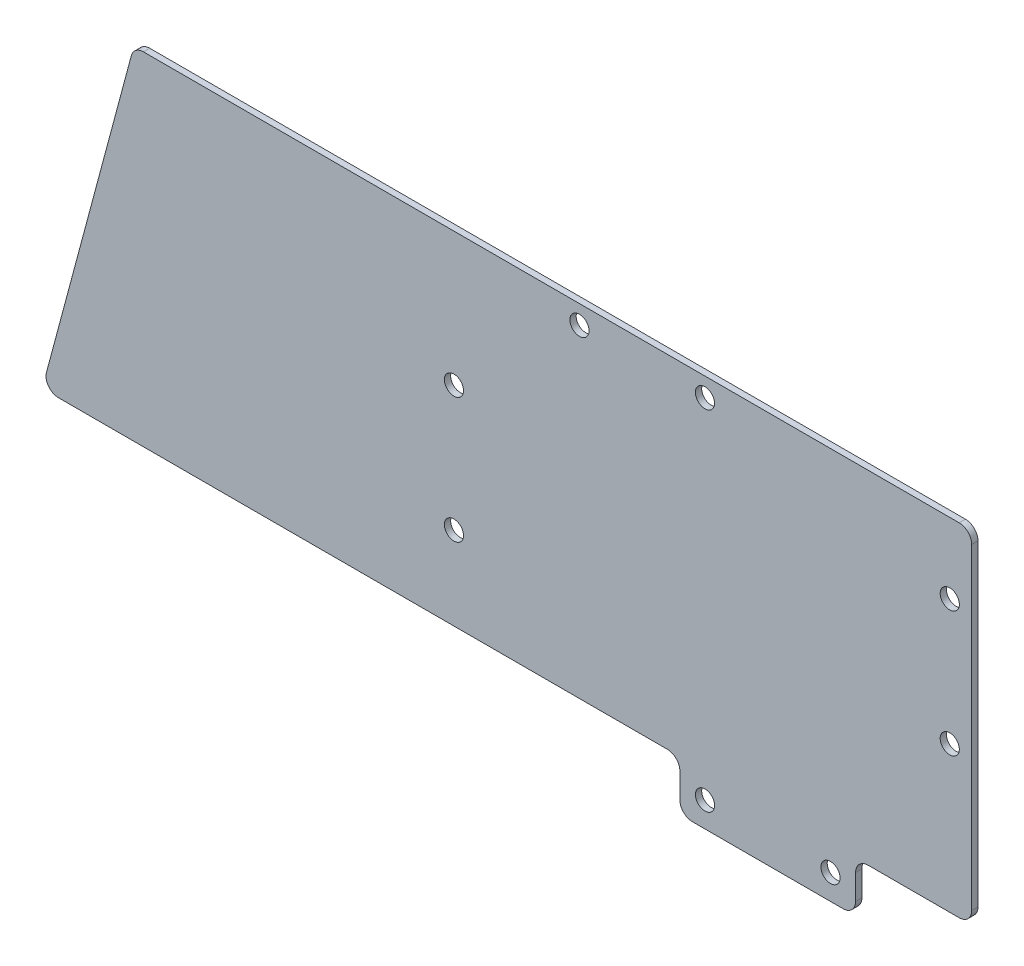
ISO-10303-21;
HEADER;
FILE_DESCRIPTION(('STEP AP214'),'2;1');
FILE_NAME('part.step','',(''),(''),'','','');
FILE_SCHEMA(('AUTOMOTIVE_DESIGN { 1 0 10303 214 1 1 1 1 }'));
ENDSEC;
DATA;
#1=APPLICATION_CONTEXT('core data for automotive mechanical design processes');
#2=APPLICATION_PROTOCOL_DEFINITION('international standard','automotive_design',2000,#1);
#3=PRODUCT_CONTEXT('',#1,'mechanical');
#4=PRODUCT('Part','Part','',(#3));
#5=PRODUCT_RELATED_PRODUCT_CATEGORY('part','',(#4));
#6=PRODUCT_DEFINITION_FORMATION('','',#4);
#7=PRODUCT_DEFINITION_CONTEXT('part definition',#1,'design');
#8=PRODUCT_DEFINITION('design','',#6,#7);
#9=PRODUCT_DEFINITION_SHAPE('','',#8);
#10=(LENGTH_UNIT() NAMED_UNIT(*) SI_UNIT(.MILLI.,.METRE.));
#11=(NAMED_UNIT(*) PLANE_ANGLE_UNIT() SI_UNIT($,.RADIAN.));
#12=(NAMED_UNIT(*) SI_UNIT($,.STERADIAN.) SOLID_ANGLE_UNIT());
#13=UNCERTAINTY_MEASURE_WITH_UNIT(LENGTH_MEASURE(1.E-05),#10,'distance_accuracy_value','');
#14=(GEOMETRIC_REPRESENTATION_CONTEXT(3) GLOBAL_UNCERTAINTY_ASSIGNED_CONTEXT((#13)) GLOBAL_UNIT_ASSIGNED_CONTEXT((#10,
#11,#12)) REPRESENTATION_CONTEXT('',''));
#15=CARTESIAN_POINT('',(0.,0.,0.));
#16=DIRECTION('',(0.,0.,1.));
#17=DIRECTION('',(1.,0.,0.));
#18=AXIS2_PLACEMENT_3D('',#15,#16,#17);
#19=CARTESIAN_POINT('',(42.5,0.,1.));
#20=DIRECTION('',(1.,0.,0.));
#21=DIRECTION('',(0.,1.,0.));
#22=AXIS2_PLACEMENT_3D('',#19,#20,#21);
#23=PLANE('',#22);
#24=DIRECTION('',(0.,-1.,0.));
#25=VECTOR('',#24,1.);
#26=CARTESIAN_POINT('',(42.5,0.,1.));
#27=LINE('',#26,#25);
#28=CARTESIAN_POINT('',(42.5,56.5,1.));
#29=VERTEX_POINT('',#28);
#30=CARTESIAN_POINT('',(42.5,6.,1.));
#31=VERTEX_POINT('',#30);
#32=EDGE_CURVE('E287',#29,#31,#27,.T.);
#33=ORIENTED_EDGE('',*,*,#32,.T.);
#34=DIRECTION('',(0.,0.,-1.));
#35=VECTOR('',#34,1.);
#36=CARTESIAN_POINT('',(42.5,6.,0.));
#37=LINE('',#36,#35);
#38=CARTESIAN_POINT('',(42.5,6.,0.));
#39=VERTEX_POINT('',#38);
#40=EDGE_CURVE('E162',#31,#39,#37,.T.);
#41=ORIENTED_EDGE('',*,*,#40,.T.);
#42=DIRECTION('',(0.,-1.,0.));
#43=VECTOR('',#42,1.);
#44=CARTESIAN_POINT('',(42.5,0.,0.));
#45=LINE('',#44,#43);
#46=CARTESIAN_POINT('',(42.5,56.5,0.));
#47=VERTEX_POINT('',#46);
#48=EDGE_CURVE('E155',#47,#39,#45,.T.);
#49=ORIENTED_EDGE('',*,*,#48,.F.);
#50=DIRECTION('',(0.,0.,-1.));
#51=VECTOR('',#50,1.);
#52=CARTESIAN_POINT('',(42.5,56.5,1.));
#53=LINE('',#52,#51);
#54=EDGE_CURVE('E167',#47,#29,#53,.F.);
#55=ORIENTED_EDGE('',*,*,#54,.T.);
#56=EDGE_LOOP('',(#33,#41,#49,#55));
#57=FACE_BOUND('',#56,.T.);
#58=ADVANCED_FACE('F37',(#57),#23,.T.);
#59=CARTESIAN_POINT('',(0.,58.5,1.));
#60=DIRECTION('',(0.,1.,0.));
#61=DIRECTION('',(0.,0.,1.));
#62=AXIS2_PLACEMENT_3D('',#59,#60,#61);
#63=PLANE('',#62);
#64=DIRECTION('',(1.,0.,0.));
#65=VECTOR('',#64,1.);
#66=CARTESIAN_POINT('',(0.,58.5,0.));
#67=LINE('',#66,#65);
#68=CARTESIAN_POINT('',(-89.4653460240421,58.5,0.));
#69=VERTEX_POINT('',#68);
#70=CARTESIAN_POINT('',(40.5,58.5,0.));
#71=VERTEX_POINT('',#70);
#72=EDGE_CURVE('E156',#69,#71,#67,.T.);
#73=ORIENTED_EDGE('',*,*,#72,.F.);
#74=DIRECTION('',(0.,0.,1.));
#75=VECTOR('',#74,1.);
#76=CARTESIAN_POINT('',(-89.4653460240421,58.5,1.));
#77=LINE('',#76,#75);
#78=CARTESIAN_POINT('',(-89.4653460240421,58.5,1.));
#79=VERTEX_POINT('',#78);
#80=EDGE_CURVE('E11',#69,#79,#77,.T.);
#81=ORIENTED_EDGE('',*,*,#80,.T.);
#82=DIRECTION('',(1.,0.,0.));
#83=VECTOR('',#82,1.);
#84=CARTESIAN_POINT('',(0.,58.5,1.));
#85=LINE('',#84,#83);
#86=CARTESIAN_POINT('',(40.5,58.5,1.));
#87=VERTEX_POINT('',#86);
#88=EDGE_CURVE('E281',#79,#87,#85,.T.);
#89=ORIENTED_EDGE('',*,*,#88,.T.);
#90=DIRECTION('',(0.,0.,-1.));
#91=VECTOR('',#90,1.);
#92=CARTESIAN_POINT('',(40.5,58.5,1.));
#93=LINE('',#92,#91);
#94=EDGE_CURVE('E221',#87,#71,#93,.T.);
#95=ORIENTED_EDGE('',*,*,#94,.T.);
#96=EDGE_LOOP('',(#73,#81,#89,#95));
#97=FACE_BOUND('',#96,.T.);
#98=ADVANCED_FACE('F385',(#97),#63,.T.);
#99=CARTESIAN_POINT('',(0.,4.,1.));
#100=DIRECTION('',(0.,1.,0.));
#101=DIRECTION('',(0.,0.,1.));
#102=AXIS2_PLACEMENT_3D('',#99,#100,#101);
#103=PLANE('',#102);
#104=DIRECTION('',(1.,0.,0.));
#105=VECTOR('',#104,1.);
#106=CARTESIAN_POINT('',(0.,4.,1.));
#107=LINE('',#106,#105);
#108=CARTESIAN_POINT('',(-102.996780241814,4.,1.));
#109=VERTEX_POINT('',#108);
#110=CARTESIAN_POINT('',(-6.,4.,1.));
#111=VERTEX_POINT('',#110);
#112=EDGE_CURVE('E276',#109,#111,#107,.T.);
#113=ORIENTED_EDGE('',*,*,#112,.F.);
#114=DIRECTION('',(0.,0.,1.));
#115=VECTOR('',#114,1.);
#116=CARTESIAN_POINT('',(-102.996780241814,4.,0.));
#117=LINE('',#116,#115);
#118=CARTESIAN_POINT('',(-102.996780241814,4.,0.));
#119=VERTEX_POINT('',#118);
#120=EDGE_CURVE('E60',#109,#119,#117,.F.);
#121=ORIENTED_EDGE('',*,*,#120,.T.);
#122=DIRECTION('',(1.,0.,0.));
#123=VECTOR('',#122,1.);
#124=CARTESIAN_POINT('',(0.,4.,0.));
#125=LINE('',#124,#123);
#126=CARTESIAN_POINT('',(-6.,4.,0.));
#127=VERTEX_POINT('',#126);
#128=EDGE_CURVE('E261',#119,#127,#125,.T.);
#129=ORIENTED_EDGE('',*,*,#128,.T.);
#130=DIRECTION('',(0.,0.,-1.));
#131=VECTOR('',#130,1.);
#132=CARTESIAN_POINT('',(-6.,4.,1.));
#133=LINE('',#132,#131);
#134=EDGE_CURVE('E218',#127,#111,#133,.F.);
#135=ORIENTED_EDGE('',*,*,#134,.T.);
#136=EDGE_LOOP('',(#113,#121,#129,#135));
#137=FACE_BOUND('',#136,.T.);
#138=ADVANCED_FACE('F277',(#137),#103,.F.);
#139=CARTESIAN_POINT('',(-4.,0.,1.));
#140=DIRECTION('',(1.,0.,0.));
#141=DIRECTION('',(0.,0.,-1.));
#142=AXIS2_PLACEMENT_3D('',#139,#140,#141);
#143=PLANE('',#142);
#144=DIRECTION('',(0.,-1.,0.));
#145=VECTOR('',#144,1.);
#146=CARTESIAN_POINT('',(-4.,0.,0.));
#147=LINE('',#146,#145);
#148=CARTESIAN_POINT('',(-4.,2.,0.));
#149=VERTEX_POINT('',#148);
#150=CARTESIAN_POINT('',(-4.,-2.,0.));
#151=VERTEX_POINT('',#150);
#152=EDGE_CURVE('E305',#149,#151,#147,.T.);
#153=ORIENTED_EDGE('',*,*,#152,.T.);
#154=DIRECTION('',(0.,0.,-1.));
#155=VECTOR('',#154,1.);
#156=CARTESIAN_POINT('',(-4.,-2.,1.));
#157=LINE('',#156,#155);
#158=CARTESIAN_POINT('',(-4.,-2.,1.));
#159=VERTEX_POINT('',#158);
#160=EDGE_CURVE('E216',#151,#159,#157,.F.);
#161=ORIENTED_EDGE('',*,*,#160,.T.);
#162=DIRECTION('',(0.,-1.,0.));
#163=VECTOR('',#162,1.);
#164=CARTESIAN_POINT('',(-4.,0.,1.));
#165=LINE('',#164,#163);
#166=CARTESIAN_POINT('',(-4.,2.,1.));
#167=VERTEX_POINT('',#166);
#168=EDGE_CURVE('E280',#167,#159,#165,.T.);
#169=ORIENTED_EDGE('',*,*,#168,.F.);
#170=DIRECTION('',(0.,0.,-1.));
#171=VECTOR('',#170,1.);
#172=CARTESIAN_POINT('',(-4.,2.,0.));
#173=LINE('',#172,#171);
#174=EDGE_CURVE('E213',#167,#149,#173,.T.);
#175=ORIENTED_EDGE('',*,*,#174,.T.);
#176=EDGE_LOOP('',(#153,#161,#169,#175));
#177=FACE_BOUND('',#176,.T.);
#178=ADVANCED_FACE('F506',(#177),#143,.F.);
#179=CARTESIAN_POINT('',(0.,-4.,1.));
#180=DIRECTION('',(0.,-1.,0.));
#181=DIRECTION('',(0.,0.,-1.));
#182=AXIS2_PLACEMENT_3D('',#179,#180,#181);
#183=PLANE('',#182);
#184=DIRECTION('',(-1.,0.,0.));
#185=VECTOR('',#184,1.);
#186=CARTESIAN_POINT('',(0.,-4.,0.));
#187=LINE('',#186,#185);
#188=CARTESIAN_POINT('',(22.,-4.,0.));
#189=VERTEX_POINT('',#188);
#190=CARTESIAN_POINT('',(-2.,-4.,0.));
#191=VERTEX_POINT('',#190);
#192=EDGE_CURVE('E309',#189,#191,#187,.T.);
#193=ORIENTED_EDGE('',*,*,#192,.F.);
#194=DIRECTION('',(0.,0.,-1.));
#195=VECTOR('',#194,1.);
#196=CARTESIAN_POINT('',(22.,-4.,1.));
#197=LINE('',#196,#195);
#198=CARTESIAN_POINT('',(22.,-4.,1.));
#199=VERTEX_POINT('',#198);
#200=EDGE_CURVE('E211',#189,#199,#197,.F.);
#201=ORIENTED_EDGE('',*,*,#200,.T.);
#202=DIRECTION('',(-1.,0.,0.));
#203=VECTOR('',#202,1.);
#204=CARTESIAN_POINT('',(0.,-4.,1.));
#205=LINE('',#204,#203);
#206=CARTESIAN_POINT('',(-2.,-4.,1.));
#207=VERTEX_POINT('',#206);
#208=EDGE_CURVE('E285',#199,#207,#205,.T.);
#209=ORIENTED_EDGE('',*,*,#208,.T.);
#210=DIRECTION('',(0.,0.,-1.));
#211=VECTOR('',#210,1.);
#212=CARTESIAN_POINT('',(-2.,-4.,0.));
#213=LINE('',#212,#211);
#214=EDGE_CURVE('E208',#207,#191,#213,.T.);
#215=ORIENTED_EDGE('',*,*,#214,.T.);
#216=EDGE_LOOP('',(#193,#201,#209,#215));
#217=FACE_BOUND('',#216,.T.);
#218=ADVANCED_FACE('F600',(#217),#183,.T.);
#219=CARTESIAN_POINT('',(24.,0.,1.));
#220=DIRECTION('',(1.,0.,0.));
#221=DIRECTION('',(0.,0.,-1.));
#222=AXIS2_PLACEMENT_3D('',#219,#220,#221);
#223=PLANE('',#222);
#224=DIRECTION('',(0.,-1.,0.));
#225=VECTOR('',#224,1.);
#226=CARTESIAN_POINT('',(24.,0.,0.));
#227=LINE('',#226,#225);
#228=CARTESIAN_POINT('',(24.,2.,0.));
#229=VERTEX_POINT('',#228);
#230=CARTESIAN_POINT('',(24.,-2.,0.));
#231=VERTEX_POINT('',#230);
#232=EDGE_CURVE('E312',#229,#231,#227,.T.);
#233=ORIENTED_EDGE('',*,*,#232,.F.);
#234=DIRECTION('',(0.,0.,-1.));
#235=VECTOR('',#234,1.);
#236=CARTESIAN_POINT('',(24.,2.,1.));
#237=LINE('',#236,#235);
#238=CARTESIAN_POINT('',(24.,2.,1.));
#239=VERTEX_POINT('',#238);
#240=EDGE_CURVE('E206',#229,#239,#237,.F.);
#241=ORIENTED_EDGE('',*,*,#240,.T.);
#242=DIRECTION('',(0.,-1.,0.));
#243=VECTOR('',#242,1.);
#244=CARTESIAN_POINT('',(24.,0.,1.));
#245=LINE('',#244,#243);
#246=CARTESIAN_POINT('',(24.,-2.,1.));
#247=VERTEX_POINT('',#246);
#248=EDGE_CURVE('E290',#239,#247,#245,.T.);
#249=ORIENTED_EDGE('',*,*,#248,.T.);
#250=DIRECTION('',(0.,0.,-1.));
#251=VECTOR('',#250,1.);
#252=CARTESIAN_POINT('',(24.,-2.,1.));
#253=LINE('',#252,#251);
#254=EDGE_CURVE('E203',#247,#231,#253,.T.);
#255=ORIENTED_EDGE('',*,*,#254,.T.);
#256=EDGE_LOOP('',(#233,#241,#249,#255));
#257=FACE_BOUND('',#256,.T.);
#258=ADVANCED_FACE('F582',(#257),#223,.T.);
#259=CARTESIAN_POINT('',(20.,0.,1.));
#260=DIRECTION('',(0.,0.,-1.));
#261=DIRECTION('',(-1.,0.,0.));
#262=AXIS2_PLACEMENT_3D('',#259,#260,#261);
#263=CYLINDRICAL_SURFACE('',#262,1.525);
#264=CARTESIAN_POINT('',(20.,0.,1.));
#265=DIRECTION('',(0.,0.,1.));
#266=DIRECTION('',(1.,0.,0.));
#267=AXIS2_PLACEMENT_3D('',#264,#265,#266);
#268=CIRCLE('',#267,1.525);
#269=CARTESIAN_POINT('',(21.525,0.,1.));
#270=VERTEX_POINT('',#269);
#271=EDGE_CURVE('E180',#270,#270,#268,.T.);
#272=ORIENTED_EDGE('',*,*,#271,.T.);
#273=EDGE_LOOP('',(#272));
#274=FACE_BOUND('',#273,.T.);
#275=CARTESIAN_POINT('',(20.,0.,0.));
#276=DIRECTION('',(0.,0.,1.));
#277=DIRECTION('',(1.,0.,0.));
#278=AXIS2_PLACEMENT_3D('',#275,#276,#277);
#279=CIRCLE('',#278,1.525);
#280=CARTESIAN_POINT('',(21.525,0.,0.));
#281=VERTEX_POINT('',#280);
#282=EDGE_CURVE('E314',#281,#281,#279,.T.);
#283=ORIENTED_EDGE('',*,*,#282,.F.);
#284=EDGE_LOOP('',(#283));
#285=FACE_BOUND('',#284,.T.);
#286=ADVANCED_FACE('F578',(#274,#285),#263,.F.);
#287=CARTESIAN_POINT('',(26.,4.,0.));
#288=VERTEX_POINT('',#287);
#289=CARTESIAN_POINT('',(40.5,4.,0.));
#290=VERTEX_POINT('',#289);
#291=EDGE_CURVE('E306',#288,#290,#125,.T.);
#292=ORIENTED_EDGE('',*,*,#291,.T.);
#293=DIRECTION('',(0.,0.,-1.));
#294=VECTOR('',#293,1.);
#295=CARTESIAN_POINT('',(40.5,4.,1.));
#296=LINE('',#295,#294);
#297=CARTESIAN_POINT('',(40.5,4.,1.));
#298=VERTEX_POINT('',#297);
#299=EDGE_CURVE('E194',#290,#298,#296,.F.);
#300=ORIENTED_EDGE('',*,*,#299,.T.);
#301=CARTESIAN_POINT('',(26.,4.,1.));
#302=VERTEX_POINT('',#301);
#303=EDGE_CURVE('E283',#302,#298,#107,.T.);
#304=ORIENTED_EDGE('',*,*,#303,.F.);
#305=DIRECTION('',(0.,0.,-1.));
#306=VECTOR('',#305,1.);
#307=CARTESIAN_POINT('',(26.,4.,1.));
#308=LINE('',#307,#306);
#309=EDGE_CURVE('E191',#302,#288,#308,.T.);
#310=ORIENTED_EDGE('',*,*,#309,.T.);
#311=EDGE_LOOP('',(#292,#300,#304,#310));
#312=FACE_BOUND('',#311,.T.);
#313=ADVANCED_FACE('F322',(#312),#103,.F.);
#314=CARTESIAN_POINT('',(0.,0.,1.));
#315=DIRECTION('',(0.,0.,-1.));
#316=DIRECTION('',(-1.,0.,0.));
#317=AXIS2_PLACEMENT_3D('',#314,#315,#316);
#318=CYLINDRICAL_SURFACE('',#317,1.525);
#319=CARTESIAN_POINT('',(0.,0.,1.));
#320=DIRECTION('',(0.,0.,1.));
#321=DIRECTION('',(1.,0.,0.));
#322=AXIS2_PLACEMENT_3D('',#319,#320,#321);
#323=CIRCLE('',#322,1.525);
#324=CARTESIAN_POINT('',(1.525,0.,1.));
#325=VERTEX_POINT('',#324);
#326=EDGE_CURVE('E176',#325,#325,#323,.T.);
#327=ORIENTED_EDGE('',*,*,#326,.T.);
#328=EDGE_LOOP('',(#327));
#329=FACE_BOUND('',#328,.T.);
#330=CARTESIAN_POINT('',(0.,0.,0.));
#331=DIRECTION('',(0.,0.,1.));
#332=DIRECTION('',(1.,0.,0.));
#333=AXIS2_PLACEMENT_3D('',#330,#331,#332);
#334=CIRCLE('',#333,1.525);
#335=CARTESIAN_POINT('',(1.525,0.,0.));
#336=VERTEX_POINT('',#335);
#337=EDGE_CURVE('E183',#336,#336,#334,.T.);
#338=ORIENTED_EDGE('',*,*,#337,.F.);
#339=EDGE_LOOP('',(#338));
#340=FACE_BOUND('',#339,.T.);
#341=ADVANCED_FACE('F352',(#329,#340),#318,.F.);
#342=CARTESIAN_POINT('',(0.,0.,1.));
#343=DIRECTION('',(0.,0.,1.));
#344=DIRECTION('',(1.,0.,0.));
#345=AXIS2_PLACEMENT_3D('',#342,#343,#344);
#346=PLANE('',#345);
#347=DIRECTION('',(-0.258819045102521,-0.965925826289068,0.));
#348=VECTOR('',#347,1.);
#349=CARTESIAN_POINT('',(-99.529155872192,26.6687569393052,1.));
#350=LINE('',#349,#348);
#351=CARTESIAN_POINT('',(-91.3971976766202,57.017638090205,1.));
#352=VERTEX_POINT('',#351);
#353=CARTESIAN_POINT('',(-104.928631894392,6.51763809020505,1.));
#354=VERTEX_POINT('',#353);
#355=EDGE_CURVE('E270',#352,#354,#350,.T.);
#356=ORIENTED_EDGE('',*,*,#355,.T.);
#357=CARTESIAN_POINT('',(-102.996780241814,6.,1.));
#358=DIRECTION('',(0.,0.,1.));
#359=DIRECTION('',(1.,0.,0.));
#360=AXIS2_PLACEMENT_3D('',#357,#358,#359);
#361=CIRCLE('',#360,2.);
#362=EDGE_CURVE('E255',#354,#109,#361,.T.);
#363=ORIENTED_EDGE('',*,*,#362,.T.);
#364=ORIENTED_EDGE('',*,*,#112,.T.);
#365=CARTESIAN_POINT('',(-6.,2.,1.));
#366=DIRECTION('',(0.,0.,1.));
#367=DIRECTION('',(1.,0.,0.));
#368=AXIS2_PLACEMENT_3D('',#365,#366,#367);
#369=CIRCLE('',#368,2.);
#370=EDGE_CURVE('E230',#111,#167,#369,.F.);
#371=ORIENTED_EDGE('',*,*,#370,.T.);
#372=ORIENTED_EDGE('',*,*,#168,.T.);
#373=CARTESIAN_POINT('',(-2.,-2.,1.));
#374=DIRECTION('',(0.,0.,1.));
#375=DIRECTION('',(1.,0.,0.));
#376=AXIS2_PLACEMENT_3D('',#373,#374,#375);
#377=CIRCLE('',#376,2.);
#378=EDGE_CURVE('E197',#159,#207,#377,.T.);
#379=ORIENTED_EDGE('',*,*,#378,.T.);
#380=ORIENTED_EDGE('',*,*,#208,.F.);
#381=CARTESIAN_POINT('',(22.,-2.,1.));
#382=DIRECTION('',(0.,0.,1.));
#383=DIRECTION('',(1.,0.,0.));
#384=AXIS2_PLACEMENT_3D('',#381,#382,#383);
#385=CIRCLE('',#384,2.);
#386=EDGE_CURVE('E199',#199,#247,#385,.T.);
#387=ORIENTED_EDGE('',*,*,#386,.T.);
#388=ORIENTED_EDGE('',*,*,#248,.F.);
#389=CARTESIAN_POINT('',(26.,2.,1.));
#390=DIRECTION('',(0.,0.,1.));
#391=DIRECTION('',(1.,0.,0.));
#392=AXIS2_PLACEMENT_3D('',#389,#390,#391);
#393=CIRCLE('',#392,2.);
#394=EDGE_CURVE('E225',#239,#302,#393,.F.);
#395=ORIENTED_EDGE('',*,*,#394,.T.);
#396=ORIENTED_EDGE('',*,*,#303,.T.);
#397=CARTESIAN_POINT('',(40.5,6.,1.));
#398=DIRECTION('',(0.,0.,1.));
#399=DIRECTION('',(1.,0.,0.));
#400=AXIS2_PLACEMENT_3D('',#397,#398,#399);
#401=CIRCLE('',#400,2.);
#402=EDGE_CURVE('E201',#298,#31,#401,.T.);
#403=ORIENTED_EDGE('',*,*,#402,.T.);
#404=ORIENTED_EDGE('',*,*,#32,.F.);
#405=CARTESIAN_POINT('',(40.5,56.5,1.));
#406=DIRECTION('',(0.,0.,1.));
#407=DIRECTION('',(1.,0.,0.));
#408=AXIS2_PLACEMENT_3D('',#405,#406,#407);
#409=CIRCLE('',#408,2.);
#410=EDGE_CURVE('E175',#29,#87,#409,.T.);
#411=ORIENTED_EDGE('',*,*,#410,.T.);
#412=ORIENTED_EDGE('',*,*,#88,.F.);
#413=CARTESIAN_POINT('',(-89.4653460240421,56.5,1.));
#414=DIRECTION('',(0.,0.,1.));
#415=DIRECTION('',(1.,0.,0.));
#416=AXIS2_PLACEMENT_3D('',#413,#414,#415);
#417=CIRCLE('',#416,2.);
#418=EDGE_CURVE('E253',#79,#352,#417,.T.);
#419=ORIENTED_EDGE('',*,*,#418,.T.);
#420=EDGE_LOOP('',(#356,#363,#364,#371,#372,#379,#380,#387,#388,#395,#396,#403,#404,#411,#412,#419));
#421=FACE_BOUND('',#420,.T.);
#422=CARTESIAN_POINT('',(-20.,55.5,1.));
#423=DIRECTION('',(0.,0.,1.));
#424=DIRECTION('',(1.,0.,0.));
#425=AXIS2_PLACEMENT_3D('',#422,#423,#424);
#426=CIRCLE('',#425,1.525);
#427=CARTESIAN_POINT('',(-18.475,55.5,1.));
#428=VERTEX_POINT('',#427);
#429=EDGE_CURVE('E245',#428,#428,#426,.T.);
#430=ORIENTED_EDGE('',*,*,#429,.F.);
#431=EDGE_LOOP('',(#430));
#432=FACE_BOUND('',#431,.T.);
#433=CARTESIAN_POINT('',(0.,55.5,1.));
#434=DIRECTION('',(0.,0.,1.));
#435=DIRECTION('',(1.,0.,0.));
#436=AXIS2_PLACEMENT_3D('',#433,#434,#435);
#437=CIRCLE('',#436,1.525);
#438=CARTESIAN_POINT('',(1.52499999999999,55.5,1.));
#439=VERTEX_POINT('',#438);
#440=EDGE_CURVE('E269',#439,#439,#437,.T.);
#441=ORIENTED_EDGE('',*,*,#440,.F.);
#442=EDGE_LOOP('',(#441));
#443=FACE_BOUND('',#442,.T.);
#444=CARTESIAN_POINT('',(39.,27.25,1.));
#445=DIRECTION('',(0.,0.,1.));
#446=DIRECTION('',(1.,0.,0.));
#447=AXIS2_PLACEMENT_3D('',#444,#445,#446);
#448=CIRCLE('',#447,1.525);
#449=CARTESIAN_POINT('',(40.525,27.25,1.));
#450=VERTEX_POINT('',#449);
#451=EDGE_CURVE('E237',#450,#450,#448,.T.);
#452=ORIENTED_EDGE('',*,*,#451,.F.);
#453=EDGE_LOOP('',(#452));
#454=FACE_BOUND('',#453,.T.);
#455=CARTESIAN_POINT('',(39.,47.25,1.));
#456=DIRECTION('',(0.,0.,1.));
#457=DIRECTION('',(1.,0.,0.));
#458=AXIS2_PLACEMENT_3D('',#455,#456,#457);
#459=CIRCLE('',#458,1.525);
#460=CARTESIAN_POINT('',(40.525,47.25,1.));
#461=VERTEX_POINT('',#460);
#462=EDGE_CURVE('E248',#461,#461,#459,.T.);
#463=ORIENTED_EDGE('',*,*,#462,.F.);
#464=EDGE_LOOP('',(#463));
#465=FACE_BOUND('',#464,.T.);
#466=CARTESIAN_POINT('',(-40.,37.25,1.));
#467=DIRECTION('',(0.,0.,1.));
#468=DIRECTION('',(1.,0.,0.));
#469=AXIS2_PLACEMENT_3D('',#466,#467,#468);
#470=CIRCLE('',#469,1.525);
#471=CARTESIAN_POINT('',(-38.475,37.25,1.));
#472=VERTEX_POINT('',#471);
#473=EDGE_CURVE('E333',#472,#472,#470,.T.);
#474=ORIENTED_EDGE('',*,*,#473,.F.);
#475=EDGE_LOOP('',(#474));
#476=FACE_BOUND('',#475,.T.);
#477=CARTESIAN_POINT('',(-40.,17.25,1.));
#478=DIRECTION('',(0.,0.,1.));
#479=DIRECTION('',(1.,0.,0.));
#480=AXIS2_PLACEMENT_3D('',#477,#478,#479);
#481=CIRCLE('',#480,1.525);
#482=CARTESIAN_POINT('',(-38.475,17.25,1.));
#483=VERTEX_POINT('',#482);
#484=EDGE_CURVE('E240',#483,#483,#481,.T.);
#485=ORIENTED_EDGE('',*,*,#484,.F.);
#486=EDGE_LOOP('',(#485));
#487=FACE_BOUND('',#486,.T.);
#488=ORIENTED_EDGE('',*,*,#271,.F.);
#489=EDGE_LOOP('',(#488));
#490=FACE_BOUND('',#489,.T.);
#491=ORIENTED_EDGE('',*,*,#326,.F.);
#492=EDGE_LOOP('',(#491));
#493=FACE_BOUND('',#492,.T.);
#494=ADVANCED_FACE('F274',(#421,#432,#443,#454,#465,#476,#487,#490,#493),#346,.T.);
#495=CARTESIAN_POINT('',(0.,0.,0.));
#496=DIRECTION('',(0.,0.,1.));
#497=DIRECTION('',(1.,0.,0.));
#498=AXIS2_PLACEMENT_3D('',#495,#496,#497);
#499=PLANE('',#498);
#500=CARTESIAN_POINT('',(-20.,55.5,0.));
#501=DIRECTION('',(0.,0.,1.));
#502=DIRECTION('',(1.,0.,0.));
#503=AXIS2_PLACEMENT_3D('',#500,#501,#502);
#504=CIRCLE('',#503,1.525);
#505=CARTESIAN_POINT('',(-18.475,55.5,0.));
#506=VERTEX_POINT('',#505);
#507=EDGE_CURVE('E244',#506,#506,#504,.T.);
#508=ORIENTED_EDGE('',*,*,#507,.T.);
#509=EDGE_LOOP('',(#508));
#510=FACE_BOUND('',#509,.T.);
#511=CARTESIAN_POINT('',(0.,55.5,0.));
#512=DIRECTION('',(0.,0.,1.));
#513=DIRECTION('',(1.,0.,0.));
#514=AXIS2_PLACEMENT_3D('',#511,#512,#513);
#515=CIRCLE('',#514,1.525);
#516=CARTESIAN_POINT('',(1.52499999999999,55.5,0.));
#517=VERTEX_POINT('',#516);
#518=EDGE_CURVE('E241',#517,#517,#515,.T.);
#519=ORIENTED_EDGE('',*,*,#518,.T.);
#520=EDGE_LOOP('',(#519));
#521=FACE_BOUND('',#520,.T.);
#522=CARTESIAN_POINT('',(39.,27.25,0.));
#523=DIRECTION('',(0.,0.,1.));
#524=DIRECTION('',(1.,0.,0.));
#525=AXIS2_PLACEMENT_3D('',#522,#523,#524);
#526=CIRCLE('',#525,1.525);
#527=CARTESIAN_POINT('',(40.525,27.25,0.));
#528=VERTEX_POINT('',#527);
#529=EDGE_CURVE('E236',#528,#528,#526,.T.);
#530=ORIENTED_EDGE('',*,*,#529,.T.);
#531=EDGE_LOOP('',(#530));
#532=FACE_BOUND('',#531,.T.);
#533=CARTESIAN_POINT('',(39.,47.25,0.));
#534=DIRECTION('',(0.,0.,1.));
#535=DIRECTION('',(1.,0.,0.));
#536=AXIS2_PLACEMENT_3D('',#533,#534,#535);
#537=CIRCLE('',#536,1.525);
#538=CARTESIAN_POINT('',(40.525,47.25,0.));
#539=VERTEX_POINT('',#538);
#540=EDGE_CURVE('E233',#539,#539,#537,.T.);
#541=ORIENTED_EDGE('',*,*,#540,.T.);
#542=EDGE_LOOP('',(#541));
#543=FACE_BOUND('',#542,.T.);
#544=CARTESIAN_POINT('',(-40.,37.25,0.));
#545=DIRECTION('',(0.,0.,1.));
#546=DIRECTION('',(1.,0.,0.));
#547=AXIS2_PLACEMENT_3D('',#544,#545,#546);
#548=CIRCLE('',#547,1.525);
#549=CARTESIAN_POINT('',(-38.475,37.25,0.));
#550=VERTEX_POINT('',#549);
#551=EDGE_CURVE('E170',#550,#550,#548,.T.);
#552=ORIENTED_EDGE('',*,*,#551,.T.);
#553=EDGE_LOOP('',(#552));
#554=FACE_BOUND('',#553,.T.);
#555=CARTESIAN_POINT('',(-40.,17.25,0.));
#556=DIRECTION('',(0.,0.,1.));
#557=DIRECTION('',(1.,0.,0.));
#558=AXIS2_PLACEMENT_3D('',#555,#556,#557);
#559=CIRCLE('',#558,1.525);
#560=CARTESIAN_POINT('',(-38.475,17.25,0.));
#561=VERTEX_POINT('',#560);
#562=EDGE_CURVE('E330',#561,#561,#559,.T.);
#563=ORIENTED_EDGE('',*,*,#562,.T.);
#564=EDGE_LOOP('',(#563));
#565=FACE_BOUND('',#564,.T.);
#566=ORIENTED_EDGE('',*,*,#128,.F.);
#567=CARTESIAN_POINT('',(-102.996780241814,6.,0.));
#568=DIRECTION('',(0.,0.,1.));
#569=DIRECTION('',(1.,0.,0.));
#570=AXIS2_PLACEMENT_3D('',#567,#568,#569);
#571=CIRCLE('',#570,2.);
#572=CARTESIAN_POINT('',(-104.928631894392,6.51763809020505,0.));
#573=VERTEX_POINT('',#572);
#574=EDGE_CURVE('E45',#119,#573,#571,.F.);
#575=ORIENTED_EDGE('',*,*,#574,.T.);
#576=DIRECTION('',(0.258819045102521,0.965925826289068,0.));
#577=VECTOR('',#576,1.);
#578=CARTESIAN_POINT('',(-99.529155872192,26.6687569393052,0.));
#579=LINE('',#578,#577);
#580=CARTESIAN_POINT('',(-91.3971976766202,57.017638090205,0.));
#581=VERTEX_POINT('',#580);
#582=EDGE_CURVE('E260',#573,#581,#579,.T.);
#583=ORIENTED_EDGE('',*,*,#582,.T.);
#584=CARTESIAN_POINT('',(-89.4653460240421,56.5,0.));
#585=DIRECTION('',(0.,0.,1.));
#586=DIRECTION('',(1.,0.,0.));
#587=AXIS2_PLACEMENT_3D('',#584,#585,#586);
#588=CIRCLE('',#587,2.);
#589=EDGE_CURVE('E52',#581,#69,#588,.F.);
#590=ORIENTED_EDGE('',*,*,#589,.T.);
#591=ORIENTED_EDGE('',*,*,#72,.T.);
#592=CARTESIAN_POINT('',(40.5,56.5,0.));
#593=DIRECTION('',(0.,0.,1.));
#594=DIRECTION('',(1.,0.,0.));
#595=AXIS2_PLACEMENT_3D('',#592,#593,#594);
#596=CIRCLE('',#595,2.);
#597=EDGE_CURVE('E151',#71,#47,#596,.F.);
#598=ORIENTED_EDGE('',*,*,#597,.T.);
#599=ORIENTED_EDGE('',*,*,#48,.T.);
#600=CARTESIAN_POINT('',(40.5,6.,0.));
#601=DIRECTION('',(0.,0.,1.));
#602=DIRECTION('',(1.,0.,0.));
#603=AXIS2_PLACEMENT_3D('',#600,#601,#602);
#604=CIRCLE('',#603,2.);
#605=EDGE_CURVE('E189',#39,#290,#604,.F.);
#606=ORIENTED_EDGE('',*,*,#605,.T.);
#607=ORIENTED_EDGE('',*,*,#291,.F.);
#608=CARTESIAN_POINT('',(26.,2.,0.));
#609=DIRECTION('',(0.,0.,1.));
#610=DIRECTION('',(1.,0.,0.));
#611=AXIS2_PLACEMENT_3D('',#608,#609,#610);
#612=CIRCLE('',#611,2.);
#613=EDGE_CURVE('E223',#288,#229,#612,.T.);
#614=ORIENTED_EDGE('',*,*,#613,.T.);
#615=ORIENTED_EDGE('',*,*,#232,.T.);
#616=CARTESIAN_POINT('',(22.,-2.,0.));
#617=DIRECTION('',(0.,0.,1.));
#618=DIRECTION('',(1.,0.,0.));
#619=AXIS2_PLACEMENT_3D('',#616,#617,#618);
#620=CIRCLE('',#619,2.);
#621=EDGE_CURVE('E187',#231,#189,#620,.F.);
#622=ORIENTED_EDGE('',*,*,#621,.T.);
#623=ORIENTED_EDGE('',*,*,#192,.T.);
#624=CARTESIAN_POINT('',(-2.,-2.,0.));
#625=DIRECTION('',(0.,0.,1.));
#626=DIRECTION('',(1.,0.,0.));
#627=AXIS2_PLACEMENT_3D('',#624,#625,#626);
#628=CIRCLE('',#627,2.);
#629=EDGE_CURVE('E161',#191,#151,#628,.F.);
#630=ORIENTED_EDGE('',*,*,#629,.T.);
#631=ORIENTED_EDGE('',*,*,#152,.F.);
#632=CARTESIAN_POINT('',(-6.,2.,0.));
#633=DIRECTION('',(0.,0.,1.));
#634=DIRECTION('',(1.,0.,0.));
#635=AXIS2_PLACEMENT_3D('',#632,#633,#634);
#636=CIRCLE('',#635,2.);
#637=EDGE_CURVE('E227',#149,#127,#636,.T.);
#638=ORIENTED_EDGE('',*,*,#637,.T.);
#639=EDGE_LOOP('',(#566,#575,#583,#590,#591,#598,#599,#606,#607,#614,#615,#622,#623,#630,#631,#638));
#640=FACE_BOUND('',#639,.T.);
#641=ORIENTED_EDGE('',*,*,#282,.T.);
#642=EDGE_LOOP('',(#641));
#643=FACE_BOUND('',#642,.T.);
#644=ORIENTED_EDGE('',*,*,#337,.T.);
#645=EDGE_LOOP('',(#644));
#646=FACE_BOUND('',#645,.T.);
#647=ADVANCED_FACE('F153',(#510,#521,#532,#543,#554,#565,#640,#643,#646),#499,.F.);
#648=CARTESIAN_POINT('',(-40.,17.25,0.));
#649=DIRECTION('',(0.,0.,1.));
#650=DIRECTION('',(1.,0.,0.));
#651=AXIS2_PLACEMENT_3D('',#648,#649,#650);
#652=CYLINDRICAL_SURFACE('',#651,1.525);
#653=ORIENTED_EDGE('',*,*,#562,.F.);
#654=EDGE_LOOP('',(#653));
#655=FACE_BOUND('',#654,.T.);
#656=ORIENTED_EDGE('',*,*,#484,.T.);
#657=EDGE_LOOP('',(#656));
#658=FACE_BOUND('',#657,.T.);
#659=ADVANCED_FACE('F374',(#655,#658),#652,.F.);
#660=CARTESIAN_POINT('',(-40.,37.25,0.));
#661=DIRECTION('',(0.,0.,1.));
#662=DIRECTION('',(1.,0.,0.));
#663=AXIS2_PLACEMENT_3D('',#660,#661,#662);
#664=CYLINDRICAL_SURFACE('',#663,1.525);
#665=ORIENTED_EDGE('',*,*,#551,.F.);
#666=EDGE_LOOP('',(#665));
#667=FACE_BOUND('',#666,.T.);
#668=ORIENTED_EDGE('',*,*,#473,.T.);
#669=EDGE_LOOP('',(#668));
#670=FACE_BOUND('',#669,.T.);
#671=ADVANCED_FACE('F380',(#667,#670),#664,.F.);
#672=CARTESIAN_POINT('',(40.5,6.,1.));
#673=DIRECTION('',(0.,0.,1.));
#674=DIRECTION('',(1.,0.,0.));
#675=AXIS2_PLACEMENT_3D('',#672,#673,#674);
#676=CYLINDRICAL_SURFACE('',#675,2.);
#677=ORIENTED_EDGE('',*,*,#402,.F.);
#678=ORIENTED_EDGE('',*,*,#299,.F.);
#679=ORIENTED_EDGE('',*,*,#605,.F.);
#680=ORIENTED_EDGE('',*,*,#40,.F.);
#681=EDGE_LOOP('',(#677,#678,#679,#680));
#682=FACE_BOUND('',#681,.T.);
#683=ADVANCED_FACE('F325',(#682),#676,.T.);
#684=CARTESIAN_POINT('',(26.,2.,1.));
#685=DIRECTION('',(0.,0.,-1.));
#686=DIRECTION('',(-1.,0.,0.));
#687=AXIS2_PLACEMENT_3D('',#684,#685,#686);
#688=CYLINDRICAL_SURFACE('',#687,2.);
#689=ORIENTED_EDGE('',*,*,#394,.F.);
#690=ORIENTED_EDGE('',*,*,#240,.F.);
#691=ORIENTED_EDGE('',*,*,#613,.F.);
#692=ORIENTED_EDGE('',*,*,#309,.F.);
#693=EDGE_LOOP('',(#689,#690,#691,#692));
#694=FACE_BOUND('',#693,.T.);
#695=ADVANCED_FACE('F396',(#694),#688,.F.);
#696=CARTESIAN_POINT('',(22.,-2.,1.));
#697=DIRECTION('',(0.,0.,-1.));
#698=DIRECTION('',(-1.,0.,0.));
#699=AXIS2_PLACEMENT_3D('',#696,#697,#698);
#700=CYLINDRICAL_SURFACE('',#699,2.);
#701=ORIENTED_EDGE('',*,*,#386,.F.);
#702=ORIENTED_EDGE('',*,*,#200,.F.);
#703=ORIENTED_EDGE('',*,*,#621,.F.);
#704=ORIENTED_EDGE('',*,*,#254,.F.);
#705=EDGE_LOOP('',(#701,#702,#703,#704));
#706=FACE_BOUND('',#705,.T.);
#707=ADVANCED_FACE('F399',(#706),#700,.T.);
#708=CARTESIAN_POINT('',(-2.,-2.,1.));
#709=DIRECTION('',(0.,0.,1.));
#710=DIRECTION('',(1.,0.,0.));
#711=AXIS2_PLACEMENT_3D('',#708,#709,#710);
#712=CYLINDRICAL_SURFACE('',#711,2.);
#713=ORIENTED_EDGE('',*,*,#378,.F.);
#714=ORIENTED_EDGE('',*,*,#160,.F.);
#715=ORIENTED_EDGE('',*,*,#629,.F.);
#716=ORIENTED_EDGE('',*,*,#214,.F.);
#717=EDGE_LOOP('',(#713,#714,#715,#716));
#718=FACE_BOUND('',#717,.T.);
#719=ADVANCED_FACE('F403',(#718),#712,.T.);
#720=CARTESIAN_POINT('',(-6.,2.,1.));
#721=DIRECTION('',(0.,0.,1.));
#722=DIRECTION('',(1.,0.,0.));
#723=AXIS2_PLACEMENT_3D('',#720,#721,#722);
#724=CYLINDRICAL_SURFACE('',#723,2.);
#725=ORIENTED_EDGE('',*,*,#370,.F.);
#726=ORIENTED_EDGE('',*,*,#134,.F.);
#727=ORIENTED_EDGE('',*,*,#637,.F.);
#728=ORIENTED_EDGE('',*,*,#174,.F.);
#729=EDGE_LOOP('',(#725,#726,#727,#728));
#730=FACE_BOUND('',#729,.T.);
#731=ADVANCED_FACE('F407',(#730),#724,.F.);
#732=CARTESIAN_POINT('',(40.5,56.5,1.));
#733=DIRECTION('',(0.,0.,-1.));
#734=DIRECTION('',(-1.,0.,0.));
#735=AXIS2_PLACEMENT_3D('',#732,#733,#734);
#736=CYLINDRICAL_SURFACE('',#735,2.);
#737=ORIENTED_EDGE('',*,*,#410,.F.);
#738=ORIENTED_EDGE('',*,*,#54,.F.);
#739=ORIENTED_EDGE('',*,*,#597,.F.);
#740=ORIENTED_EDGE('',*,*,#94,.F.);
#741=EDGE_LOOP('',(#737,#738,#739,#740));
#742=FACE_BOUND('',#741,.T.);
#743=ADVANCED_FACE('F173',(#742),#736,.T.);
#744=CARTESIAN_POINT('',(39.,47.25,-9.));
#745=DIRECTION('',(0.,0.,1.));
#746=DIRECTION('',(1.,0.,0.));
#747=AXIS2_PLACEMENT_3D('',#744,#745,#746);
#748=CYLINDRICAL_SURFACE('',#747,1.525);
#749=ORIENTED_EDGE('',*,*,#462,.T.);
#750=EDGE_LOOP('',(#749));
#751=FACE_BOUND('',#750,.T.);
#752=ORIENTED_EDGE('',*,*,#540,.F.);
#753=EDGE_LOOP('',(#752));
#754=FACE_BOUND('',#753,.T.);
#755=ADVANCED_FACE('F413',(#751,#754),#748,.F.);
#756=CARTESIAN_POINT('',(39.,27.25,-9.));
#757=DIRECTION('',(0.,0.,1.));
#758=DIRECTION('',(1.,0.,0.));
#759=AXIS2_PLACEMENT_3D('',#756,#757,#758);
#760=CYLINDRICAL_SURFACE('',#759,1.525);
#761=ORIENTED_EDGE('',*,*,#451,.T.);
#762=EDGE_LOOP('',(#761));
#763=FACE_BOUND('',#762,.T.);
#764=ORIENTED_EDGE('',*,*,#529,.F.);
#765=EDGE_LOOP('',(#764));
#766=FACE_BOUND('',#765,.T.);
#767=ADVANCED_FACE('F429',(#763,#766),#760,.F.);
#768=CARTESIAN_POINT('',(0.,55.5,-9.));
#769=DIRECTION('',(0.,0.,1.));
#770=DIRECTION('',(1.,0.,0.));
#771=AXIS2_PLACEMENT_3D('',#768,#769,#770);
#772=CYLINDRICAL_SURFACE('',#771,1.525);
#773=ORIENTED_EDGE('',*,*,#440,.T.);
#774=EDGE_LOOP('',(#773));
#775=FACE_BOUND('',#774,.T.);
#776=ORIENTED_EDGE('',*,*,#518,.F.);
#777=EDGE_LOOP('',(#776));
#778=FACE_BOUND('',#777,.T.);
#779=ADVANCED_FACE('F424',(#775,#778),#772,.F.);
#780=CARTESIAN_POINT('',(-20.,55.5,-9.));
#781=DIRECTION('',(0.,0.,1.));
#782=DIRECTION('',(1.,0.,0.));
#783=AXIS2_PLACEMENT_3D('',#780,#781,#782);
#784=CYLINDRICAL_SURFACE('',#783,1.525);
#785=ORIENTED_EDGE('',*,*,#429,.T.);
#786=EDGE_LOOP('',(#785));
#787=FACE_BOUND('',#786,.T.);
#788=ORIENTED_EDGE('',*,*,#507,.F.);
#789=EDGE_LOOP('',(#788));
#790=FACE_BOUND('',#789,.T.);
#791=ADVANCED_FACE('F348',(#787,#790),#784,.F.);
#792=CARTESIAN_POINT('',(-99.529155872192,26.6687569393052,-83.0024971315551));
#793=DIRECTION('',(-0.965925826289068,0.258819045102521,0.));
#794=DIRECTION('',(-0.258819045102521,-0.965925826289068,0.));
#795=AXIS2_PLACEMENT_3D('',#792,#793,#794);
#796=PLANE('',#795);
#797=ORIENTED_EDGE('',*,*,#582,.F.);
#798=DIRECTION('',(0.,0.,1.));
#799=VECTOR('',#798,1.);
#800=CARTESIAN_POINT('',(-104.928631894392,6.51763809020504,1.));
#801=LINE('',#800,#799);
#802=EDGE_CURVE('E250',#573,#354,#801,.T.);
#803=ORIENTED_EDGE('',*,*,#802,.T.);
#804=ORIENTED_EDGE('',*,*,#355,.F.);
#805=DIRECTION('',(0.,0.,1.));
#806=VECTOR('',#805,1.);
#807=CARTESIAN_POINT('',(-91.3971976766202,57.017638090205,-83.0024971315551));
#808=LINE('',#807,#806);
#809=EDGE_CURVE('E232',#352,#581,#808,.F.);
#810=ORIENTED_EDGE('',*,*,#809,.T.);
#811=EDGE_LOOP('',(#797,#803,#804,#810));
#812=FACE_BOUND('',#811,.T.);
#813=ADVANCED_FACE('F265',(#812),#796,.T.);
#814=CARTESIAN_POINT('',(-102.996780241814,6.,-83.0024971315551));
#815=DIRECTION('',(0.,0.,-1.));
#816=DIRECTION('',(-1.,0.,0.));
#817=AXIS2_PLACEMENT_3D('',#814,#815,#816);
#818=CYLINDRICAL_SURFACE('',#817,2.);
#819=ORIENTED_EDGE('',*,*,#574,.F.);
#820=ORIENTED_EDGE('',*,*,#120,.F.);
#821=ORIENTED_EDGE('',*,*,#362,.F.);
#822=ORIENTED_EDGE('',*,*,#802,.F.);
#823=EDGE_LOOP('',(#819,#820,#821,#822));
#824=FACE_BOUND('',#823,.T.);
#825=ADVANCED_FACE('F272',(#824),#818,.T.);
#826=CARTESIAN_POINT('',(-89.4653460240421,56.5,1.));
#827=DIRECTION('',(0.,0.,1.));
#828=DIRECTION('',(1.,0.,0.));
#829=AXIS2_PLACEMENT_3D('',#826,#827,#828);
#830=CYLINDRICAL_SURFACE('',#829,2.);
#831=ORIENTED_EDGE('',*,*,#589,.F.);
#832=ORIENTED_EDGE('',*,*,#809,.F.);
#833=ORIENTED_EDGE('',*,*,#418,.F.);
#834=ORIENTED_EDGE('',*,*,#80,.F.);
#835=EDGE_LOOP('',(#831,#832,#833,#834));
#836=FACE_BOUND('',#835,.T.);
#837=ADVANCED_FACE('F39',(#836),#830,.T.);
#838=CLOSED_SHELL('',(#58,#98,#138,#178,#218,#258,#286,#313,#341,#494,#647,#659,#671,#683,#695,
#707,#719,#731,#743,#755,#767,#779,#791,#813,#825,#837));
#839=MANIFOLD_SOLID_BREP('B2',#838);
#840=ADVANCED_BREP_SHAPE_REPRESENTATION('',(#18,#839),#14);
#841=SHAPE_DEFINITION_REPRESENTATION(#9,#840);
ENDSEC;
END-ISO-10303-21;
